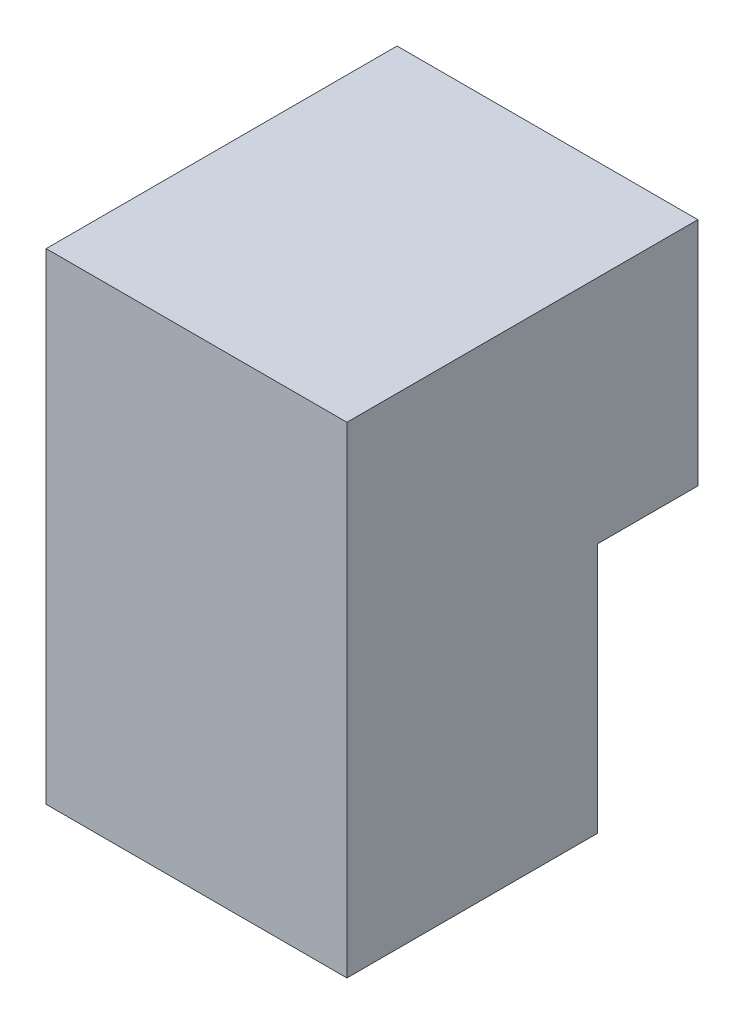
ISO-10303-21;
HEADER;
FILE_DESCRIPTION(('STEP AP214'),'2;1');
FILE_NAME('part.step','',(''),(''),'','','');
FILE_SCHEMA(('AUTOMOTIVE_DESIGN { 1 0 10303 214 1 1 1 1 }'));
ENDSEC;
DATA;
#1=APPLICATION_CONTEXT('core data for automotive mechanical design processes');
#2=APPLICATION_PROTOCOL_DEFINITION('international standard','automotive_design',2000,#1);
#3=PRODUCT_CONTEXT('',#1,'mechanical');
#4=PRODUCT('Part','Part','',(#3));
#5=PRODUCT_RELATED_PRODUCT_CATEGORY('part','',(#4));
#6=PRODUCT_DEFINITION_FORMATION('','',#4);
#7=PRODUCT_DEFINITION_CONTEXT('part definition',#1,'design');
#8=PRODUCT_DEFINITION('design','',#6,#7);
#9=PRODUCT_DEFINITION_SHAPE('','',#8);
#10=(LENGTH_UNIT() NAMED_UNIT(*) SI_UNIT(.MILLI.,.METRE.));
#11=(NAMED_UNIT(*) PLANE_ANGLE_UNIT() SI_UNIT($,.RADIAN.));
#12=(NAMED_UNIT(*) SI_UNIT($,.STERADIAN.) SOLID_ANGLE_UNIT());
#13=UNCERTAINTY_MEASURE_WITH_UNIT(LENGTH_MEASURE(1.E-05),#10,'distance_accuracy_value','');
#14=(GEOMETRIC_REPRESENTATION_CONTEXT(3) GLOBAL_UNCERTAINTY_ASSIGNED_CONTEXT((#13)) GLOBAL_UNIT_ASSIGNED_CONTEXT((#10,
#11,#12)) REPRESENTATION_CONTEXT('',''));
#15=CARTESIAN_POINT('',(0.,0.,0.));
#16=DIRECTION('',(0.,0.,1.));
#17=DIRECTION('',(1.,0.,0.));
#18=AXIS2_PLACEMENT_3D('',#15,#16,#17);
#19=CARTESIAN_POINT('',(30.,1.,0.));
#20=DIRECTION('',(0.,-1.,0.));
#21=DIRECTION('',(0.,0.,-1.));
#22=AXIS2_PLACEMENT_3D('',#19,#20,#21);
#23=PLANE('',#22);
#24=DIRECTION('',(0.,0.,1.));
#25=VECTOR('',#24,1.);
#26=CARTESIAN_POINT('',(0.,1.,0.));
#27=LINE('',#26,#25);
#28=CARTESIAN_POINT('',(0.,1.,-17.5));
#29=VERTEX_POINT('',#28);
#30=CARTESIAN_POINT('',(0.,1.,-7.5));
#31=VERTEX_POINT('',#30);
#32=EDGE_CURVE('E122',#29,#31,#27,.T.);
#33=ORIENTED_EDGE('',*,*,#32,.F.);
#34=DIRECTION('',(-1.,0.,0.));
#35=VECTOR('',#34,1.);
#36=CARTESIAN_POINT('',(30.,1.,-17.5));
#37=LINE('',#36,#35);
#38=CARTESIAN_POINT('',(30.,1.,-17.5));
#39=VERTEX_POINT('',#38);
#40=EDGE_CURVE('E11',#39,#29,#37,.T.);
#41=ORIENTED_EDGE('',*,*,#40,.F.);
#42=DIRECTION('',(0.,0.,1.));
#43=VECTOR('',#42,1.);
#44=CARTESIAN_POINT('',(30.,1.,0.));
#45=LINE('',#44,#43);
#46=CARTESIAN_POINT('',(30.,1.,-7.5));
#47=VERTEX_POINT('',#46);
#48=EDGE_CURVE('E135',#39,#47,#45,.T.);
#49=ORIENTED_EDGE('',*,*,#48,.T.);
#50=DIRECTION('',(-1.,0.,0.));
#51=VECTOR('',#50,1.);
#52=CARTESIAN_POINT('',(30.,1.,-7.5));
#53=LINE('',#52,#51);
#54=EDGE_CURVE('E85',#47,#31,#53,.T.);
#55=ORIENTED_EDGE('',*,*,#54,.T.);
#56=EDGE_LOOP('',(#33,#41,#49,#55));
#57=FACE_BOUND('',#56,.T.);
#58=ADVANCED_FACE('F41',(#57),#23,.T.);
#59=CARTESIAN_POINT('',(30.,0.,-17.5));
#60=DIRECTION('',(0.,0.,1.));
#61=DIRECTION('',(1.,0.,0.));
#62=AXIS2_PLACEMENT_3D('',#59,#60,#61);
#63=PLANE('',#62);
#64=DIRECTION('',(0.,1.,0.));
#65=VECTOR('',#64,1.);
#66=CARTESIAN_POINT('',(0.,0.,-17.5));
#67=LINE('',#66,#65);
#68=CARTESIAN_POINT('',(0.,24.,-17.5));
#69=VERTEX_POINT('',#68);
#70=EDGE_CURVE('E125',#29,#69,#67,.T.);
#71=ORIENTED_EDGE('',*,*,#70,.T.);
#72=DIRECTION('',(-1.,0.,0.));
#73=VECTOR('',#72,1.);
#74=CARTESIAN_POINT('',(30.,24.,-17.5));
#75=LINE('',#74,#73);
#76=CARTESIAN_POINT('',(30.,24.,-17.5));
#77=VERTEX_POINT('',#76);
#78=EDGE_CURVE('E49',#77,#69,#75,.T.);
#79=ORIENTED_EDGE('',*,*,#78,.F.);
#80=DIRECTION('',(0.,1.,0.));
#81=VECTOR('',#80,1.);
#82=CARTESIAN_POINT('',(30.,0.,-17.5));
#83=LINE('',#82,#81);
#84=EDGE_CURVE('E148',#39,#77,#83,.T.);
#85=ORIENTED_EDGE('',*,*,#84,.F.);
#86=ORIENTED_EDGE('',*,*,#40,.T.);
#87=EDGE_LOOP('',(#71,#79,#85,#86));
#88=FACE_BOUND('',#87,.T.);
#89=ADVANCED_FACE('F151',(#88),#63,.F.);
#90=CARTESIAN_POINT('',(30.,24.,0.));
#91=DIRECTION('',(0.,-1.,0.));
#92=DIRECTION('',(0.,0.,-1.));
#93=AXIS2_PLACEMENT_3D('',#90,#91,#92);
#94=PLANE('',#93);
#95=DIRECTION('',(0.,0.,1.));
#96=VECTOR('',#95,1.);
#97=CARTESIAN_POINT('',(0.,24.,0.));
#98=LINE('',#97,#96);
#99=CARTESIAN_POINT('',(0.,24.,17.5));
#100=VERTEX_POINT('',#99);
#101=EDGE_CURVE('E127',#69,#100,#98,.T.);
#102=ORIENTED_EDGE('',*,*,#101,.T.);
#103=DIRECTION('',(-1.,0.,0.));
#104=VECTOR('',#103,1.);
#105=CARTESIAN_POINT('',(30.,24.,17.5));
#106=LINE('',#105,#104);
#107=CARTESIAN_POINT('',(30.,24.,17.5));
#108=VERTEX_POINT('',#107);
#109=EDGE_CURVE('E109',#108,#100,#106,.T.);
#110=ORIENTED_EDGE('',*,*,#109,.F.);
#111=DIRECTION('',(0.,0.,1.));
#112=VECTOR('',#111,1.);
#113=CARTESIAN_POINT('',(30.,24.,0.));
#114=LINE('',#113,#112);
#115=EDGE_CURVE('E114',#77,#108,#114,.T.);
#116=ORIENTED_EDGE('',*,*,#115,.F.);
#117=ORIENTED_EDGE('',*,*,#78,.T.);
#118=EDGE_LOOP('',(#102,#110,#116,#117));
#119=FACE_BOUND('',#118,.T.);
#120=ADVANCED_FACE('F142',(#119),#94,.F.);
#121=CARTESIAN_POINT('',(30.,0.,17.5));
#122=DIRECTION('',(0.,0.,1.));
#123=DIRECTION('',(1.,0.,0.));
#124=AXIS2_PLACEMENT_3D('',#121,#122,#123);
#125=PLANE('',#124);
#126=DIRECTION('',(0.,1.,0.));
#127=VECTOR('',#126,1.);
#128=CARTESIAN_POINT('',(0.,0.,17.5));
#129=LINE('',#128,#127);
#130=CARTESIAN_POINT('',(0.,-24.,17.5));
#131=VERTEX_POINT('',#130);
#132=EDGE_CURVE('E104',#131,#100,#129,.T.);
#133=ORIENTED_EDGE('',*,*,#132,.F.);
#134=DIRECTION('',(-1.,0.,0.));
#135=VECTOR('',#134,1.);
#136=CARTESIAN_POINT('',(30.,-24.,17.5));
#137=LINE('',#136,#135);
#138=CARTESIAN_POINT('',(30.,-24.,17.5));
#139=VERTEX_POINT('',#138);
#140=EDGE_CURVE('E99',#139,#131,#137,.T.);
#141=ORIENTED_EDGE('',*,*,#140,.F.);
#142=DIRECTION('',(0.,1.,0.));
#143=VECTOR('',#142,1.);
#144=CARTESIAN_POINT('',(30.,0.,17.5));
#145=LINE('',#144,#143);
#146=EDGE_CURVE('E102',#139,#108,#145,.T.);
#147=ORIENTED_EDGE('',*,*,#146,.T.);
#148=ORIENTED_EDGE('',*,*,#109,.T.);
#149=EDGE_LOOP('',(#133,#141,#147,#148));
#150=FACE_BOUND('',#149,.T.);
#151=ADVANCED_FACE('F101',(#150),#125,.T.);
#152=CARTESIAN_POINT('',(30.,-24.,0.));
#153=DIRECTION('',(0.,-1.,0.));
#154=DIRECTION('',(0.,0.,-1.));
#155=AXIS2_PLACEMENT_3D('',#152,#153,#154);
#156=PLANE('',#155);
#157=DIRECTION('',(0.,0.,1.));
#158=VECTOR('',#157,1.);
#159=CARTESIAN_POINT('',(0.,-24.,0.));
#160=LINE('',#159,#158);
#161=CARTESIAN_POINT('',(0.,-24.,-7.5));
#162=VERTEX_POINT('',#161);
#163=EDGE_CURVE('E131',#162,#131,#160,.T.);
#164=ORIENTED_EDGE('',*,*,#163,.F.);
#165=DIRECTION('',(-1.,0.,0.));
#166=VECTOR('',#165,1.);
#167=CARTESIAN_POINT('',(30.,-24.,-7.5));
#168=LINE('',#167,#166);
#169=CARTESIAN_POINT('',(30.,-24.,-7.5));
#170=VERTEX_POINT('',#169);
#171=EDGE_CURVE('E78',#170,#162,#168,.T.);
#172=ORIENTED_EDGE('',*,*,#171,.F.);
#173=DIRECTION('',(0.,0.,1.));
#174=VECTOR('',#173,1.);
#175=CARTESIAN_POINT('',(30.,-24.,0.));
#176=LINE('',#175,#174);
#177=EDGE_CURVE('E112',#170,#139,#176,.T.);
#178=ORIENTED_EDGE('',*,*,#177,.T.);
#179=ORIENTED_EDGE('',*,*,#140,.T.);
#180=EDGE_LOOP('',(#164,#172,#178,#179));
#181=FACE_BOUND('',#180,.T.);
#182=ADVANCED_FACE('F117',(#181),#156,.T.);
#183=CARTESIAN_POINT('',(30.,0.,-7.5));
#184=DIRECTION('',(0.,0.,1.));
#185=DIRECTION('',(1.,0.,0.));
#186=AXIS2_PLACEMENT_3D('',#183,#184,#185);
#187=PLANE('',#186);
#188=DIRECTION('',(0.,1.,0.));
#189=VECTOR('',#188,1.);
#190=CARTESIAN_POINT('',(0.,0.,-7.5));
#191=LINE('',#190,#189);
#192=EDGE_CURVE('E133',#162,#31,#191,.T.);
#193=ORIENTED_EDGE('',*,*,#192,.T.);
#194=ORIENTED_EDGE('',*,*,#54,.F.);
#195=DIRECTION('',(0.,1.,0.));
#196=VECTOR('',#195,1.);
#197=CARTESIAN_POINT('',(30.,0.,-7.5));
#198=LINE('',#197,#196);
#199=EDGE_CURVE('E57',#170,#47,#198,.T.);
#200=ORIENTED_EDGE('',*,*,#199,.F.);
#201=ORIENTED_EDGE('',*,*,#171,.T.);
#202=EDGE_LOOP('',(#193,#194,#200,#201));
#203=FACE_BOUND('',#202,.T.);
#204=ADVANCED_FACE('F147',(#203),#187,.F.);
#205=CARTESIAN_POINT('',(30.,0.,0.));
#206=DIRECTION('',(1.,0.,0.));
#207=DIRECTION('',(0.,0.,-1.));
#208=AXIS2_PLACEMENT_3D('',#205,#206,#207);
#209=PLANE('',#208);
#210=ORIENTED_EDGE('',*,*,#48,.F.);
#211=ORIENTED_EDGE('',*,*,#84,.T.);
#212=ORIENTED_EDGE('',*,*,#115,.T.);
#213=ORIENTED_EDGE('',*,*,#146,.F.);
#214=ORIENTED_EDGE('',*,*,#177,.F.);
#215=ORIENTED_EDGE('',*,*,#199,.T.);
#216=EDGE_LOOP('',(#210,#211,#212,#213,#214,#215));
#217=FACE_BOUND('',#216,.T.);
#218=ADVANCED_FACE('F111',(#217),#209,.T.);
#219=CARTESIAN_POINT('',(0.,0.,0.));
#220=DIRECTION('',(1.,0.,0.));
#221=DIRECTION('',(0.,0.,-1.));
#222=AXIS2_PLACEMENT_3D('',#219,#220,#221);
#223=PLANE('',#222);
#224=ORIENTED_EDGE('',*,*,#32,.T.);
#225=ORIENTED_EDGE('',*,*,#192,.F.);
#226=ORIENTED_EDGE('',*,*,#163,.T.);
#227=ORIENTED_EDGE('',*,*,#132,.T.);
#228=ORIENTED_EDGE('',*,*,#101,.F.);
#229=ORIENTED_EDGE('',*,*,#70,.F.);
#230=EDGE_LOOP('',(#224,#225,#226,#227,#228,#229));
#231=FACE_BOUND('',#230,.T.);
#232=ADVANCED_FACE('F146',(#231),#223,.F.);
#233=CLOSED_SHELL('',(#58,#89,#120,#151,#182,#204,#218,#232));
#234=MANIFOLD_SOLID_BREP('B2',#233);
#235=ADVANCED_BREP_SHAPE_REPRESENTATION('',(#18,#234),#14);
#236=SHAPE_DEFINITION_REPRESENTATION(#9,#235);
ENDSEC;
END-ISO-10303-21;
